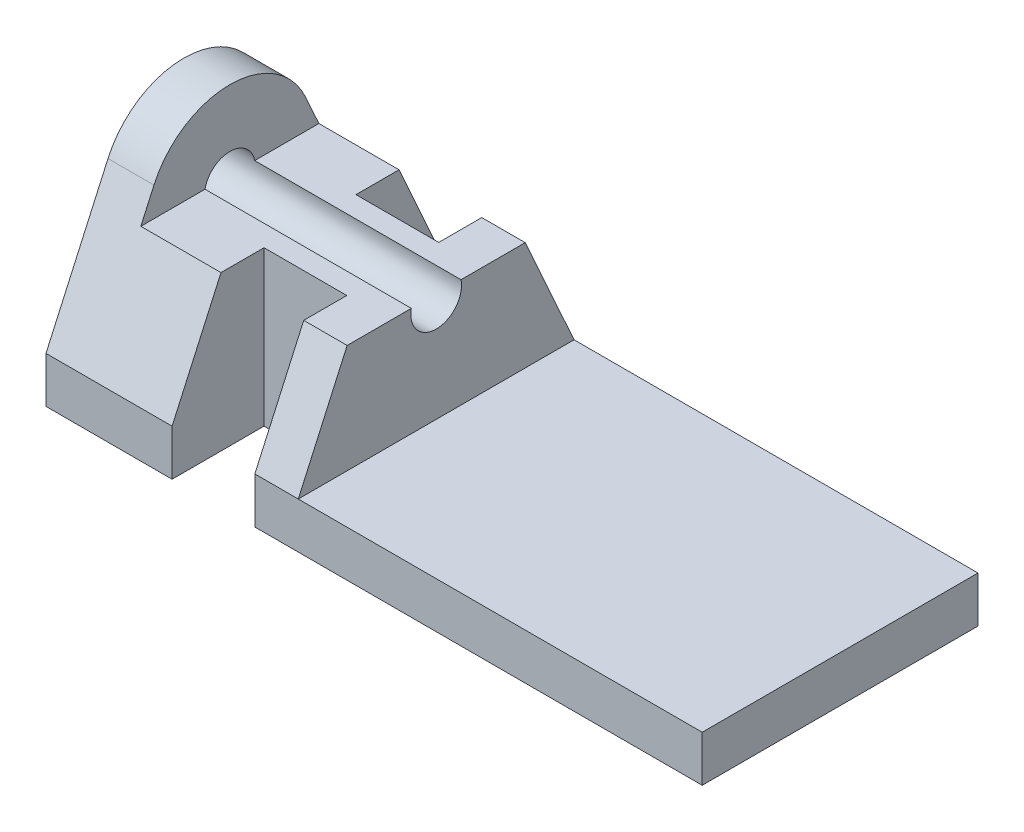
ISO-10303-21;
HEADER;
FILE_DESCRIPTION(('STEP AP214'),'2;1');
FILE_NAME('part.step','',(''),(''),'','','');
FILE_SCHEMA(('AUTOMOTIVE_DESIGN { 1 0 10303 214 1 1 1 1 }'));
ENDSEC;
DATA;
#1=APPLICATION_CONTEXT('core data for automotive mechanical design processes');
#2=APPLICATION_PROTOCOL_DEFINITION('international standard','automotive_design',2000,#1);
#3=PRODUCT_CONTEXT('',#1,'mechanical');
#4=PRODUCT('Part','Part','',(#3));
#5=PRODUCT_RELATED_PRODUCT_CATEGORY('part','',(#4));
#6=PRODUCT_DEFINITION_FORMATION('','',#4);
#7=PRODUCT_DEFINITION_CONTEXT('part definition',#1,'design');
#8=PRODUCT_DEFINITION('design','',#6,#7);
#9=PRODUCT_DEFINITION_SHAPE('','',#8);
#10=(LENGTH_UNIT() NAMED_UNIT(*) SI_UNIT(.MILLI.,.METRE.));
#11=(NAMED_UNIT(*) PLANE_ANGLE_UNIT() SI_UNIT($,.RADIAN.));
#12=(NAMED_UNIT(*) SI_UNIT($,.STERADIAN.) SOLID_ANGLE_UNIT());
#13=UNCERTAINTY_MEASURE_WITH_UNIT(LENGTH_MEASURE(1.E-05),#10,'distance_accuracy_value','');
#14=(GEOMETRIC_REPRESENTATION_CONTEXT(3) GLOBAL_UNCERTAINTY_ASSIGNED_CONTEXT((#13)) GLOBAL_UNIT_ASSIGNED_CONTEXT((#10,
#11,#12)) REPRESENTATION_CONTEXT('',''));
#15=CARTESIAN_POINT('',(0.,0.,0.));
#16=DIRECTION('',(0.,0.,1.));
#17=DIRECTION('',(1.,0.,0.));
#18=AXIS2_PLACEMENT_3D('',#15,#16,#17);
#19=CARTESIAN_POINT('',(-69.85,-6.35,19.05));
#20=DIRECTION('',(0.,0.,1.));
#21=DIRECTION('',(0.,-1.,0.));
#22=AXIS2_PLACEMENT_3D('',#19,#20,#21);
#23=PLANE('',#22);
#24=DIRECTION('',(0.,-1.,0.));
#25=VECTOR('',#24,1.);
#26=CARTESIAN_POINT('',(-52.43,-6.35,19.05));
#27=LINE('',#26,#25);
#28=CARTESIAN_POINT('',(-52.43,0.,19.05));
#29=VERTEX_POINT('',#28);
#30=CARTESIAN_POINT('',(-52.43,-6.35,19.05));
#31=VERTEX_POINT('',#30);
#32=EDGE_CURVE('E222',#29,#31,#27,.T.);
#33=ORIENTED_EDGE('',*,*,#32,.F.);
#34=DIRECTION('',(1.,0.,0.));
#35=VECTOR('',#34,1.);
#36=CARTESIAN_POINT('',(-69.85,0.,19.05));
#37=LINE('',#36,#35);
#38=CARTESIAN_POINT('',(-69.85,0.,19.05));
#39=VERTEX_POINT('',#38);
#40=EDGE_CURVE('E276',#39,#29,#37,.T.);
#41=ORIENTED_EDGE('',*,*,#40,.F.);
#42=DIRECTION('',(0.,-1.,0.));
#43=VECTOR('',#42,1.);
#44=CARTESIAN_POINT('',(-69.85,-6.35,19.05));
#45=LINE('',#44,#43);
#46=CARTESIAN_POINT('',(-69.85,-6.35,19.05));
#47=VERTEX_POINT('',#46);
#48=EDGE_CURVE('E304',#39,#47,#45,.T.);
#49=ORIENTED_EDGE('',*,*,#48,.T.);
#50=DIRECTION('',(1.,0.,0.));
#51=VECTOR('',#50,1.);
#52=CARTESIAN_POINT('',(-69.85,-6.35,19.05));
#53=LINE('',#52,#51);
#54=EDGE_CURVE('E307',#47,#31,#53,.T.);
#55=ORIENTED_EDGE('',*,*,#54,.T.);
#56=EDGE_LOOP('',(#33,#41,#49,#55));
#57=FACE_BOUND('',#56,.T.);
#58=ADVANCED_FACE('F33',(#57),#23,.T.);
#59=CARTESIAN_POINT('',(-69.85,-6.34999999999999,-19.05));
#60=DIRECTION('',(0.,0.,-1.));
#61=DIRECTION('',(0.,1.,0.));
#62=AXIS2_PLACEMENT_3D('',#59,#60,#61);
#63=PLANE('',#62);
#64=DIRECTION('',(0.,1.,0.));
#65=VECTOR('',#64,1.);
#66=CARTESIAN_POINT('',(-52.43,-6.34999999999999,-19.05));
#67=LINE('',#66,#65);
#68=CARTESIAN_POINT('',(-52.43,-6.35,-19.05));
#69=VERTEX_POINT('',#68);
#70=CARTESIAN_POINT('',(-52.43,0.,-19.05));
#71=VERTEX_POINT('',#70);
#72=EDGE_CURVE('E227',#69,#71,#67,.T.);
#73=ORIENTED_EDGE('',*,*,#72,.F.);
#74=DIRECTION('',(1.,0.,0.));
#75=VECTOR('',#74,1.);
#76=CARTESIAN_POINT('',(-69.85,-6.34999999999999,-19.05));
#77=LINE('',#76,#75);
#78=CARTESIAN_POINT('',(-69.85,-6.34999999999999,-19.05));
#79=VERTEX_POINT('',#78);
#80=EDGE_CURVE('E311',#79,#69,#77,.T.);
#81=ORIENTED_EDGE('',*,*,#80,.F.);
#82=DIRECTION('',(0.,1.,0.));
#83=VECTOR('',#82,1.);
#84=CARTESIAN_POINT('',(-69.85,-6.34999999999999,-19.05));
#85=LINE('',#84,#83);
#86=CARTESIAN_POINT('',(-69.85,0.,-19.05));
#87=VERTEX_POINT('',#86);
#88=EDGE_CURVE('E301',#79,#87,#85,.T.);
#89=ORIENTED_EDGE('',*,*,#88,.T.);
#90=DIRECTION('',(1.,0.,0.));
#91=VECTOR('',#90,1.);
#92=CARTESIAN_POINT('',(-69.85,0.,-19.05));
#93=LINE('',#92,#91);
#94=EDGE_CURVE('E265',#87,#71,#93,.T.);
#95=ORIENTED_EDGE('',*,*,#94,.T.);
#96=EDGE_LOOP('',(#73,#81,#89,#95));
#97=FACE_BOUND('',#96,.T.);
#98=ADVANCED_FACE('F401',(#97),#63,.T.);
#99=CARTESIAN_POINT('',(-69.85,0.,-19.05));
#100=DIRECTION('',(0.,-0.410407540402517,0.911902215580572));
#101=DIRECTION('',(0.,-0.911902215580572,-0.410407540402517));
#102=AXIS2_PLACEMENT_3D('',#99,#100,#101);
#103=PLANE('',#102);
#104=DIRECTION('',(-1.,0.,0.));
#105=VECTOR('',#104,1.);
#106=CARTESIAN_POINT('',(0.,15.,-12.2991521559487));
#107=LINE('',#106,#105);
#108=CARTESIAN_POINT('',(-52.43,15.,-12.2991521559487));
#109=VERTEX_POINT('',#108);
#110=CARTESIAN_POINT('',(-63.5,15.,-12.2991521559487));
#111=VERTEX_POINT('',#110);
#112=EDGE_CURVE('E323',#109,#111,#107,.T.);
#113=ORIENTED_EDGE('',*,*,#112,.F.);
#114=DIRECTION('',(0.,-0.911902215580572,-0.410407540402517));
#115=VECTOR('',#114,1.);
#116=CARTESIAN_POINT('',(-52.43,0.,-19.05));
#117=LINE('',#116,#115);
#118=EDGE_CURVE('E11',#109,#71,#117,.T.);
#119=ORIENTED_EDGE('',*,*,#118,.T.);
#120=ORIENTED_EDGE('',*,*,#94,.F.);
#121=DIRECTION('',(0.,-0.911902215580572,-0.410407540402517));
#122=VECTOR('',#121,1.);
#123=CARTESIAN_POINT('',(-69.85,0.,-19.05));
#124=LINE('',#123,#122);
#125=CARTESIAN_POINT('',(-69.85,19.0267757146289,-10.4868754791766));
#126=VERTEX_POINT('',#125);
#127=EDGE_CURVE('E261',#126,#87,#124,.T.);
#128=ORIENTED_EDGE('',*,*,#127,.F.);
#129=DIRECTION('',(1.,0.,0.));
#130=VECTOR('',#129,1.);
#131=CARTESIAN_POINT('',(-69.85,19.0267757146289,-10.4868754791766));
#132=LINE('',#131,#130);
#133=CARTESIAN_POINT('',(-63.5,19.0267757146289,-10.4868754791766));
#134=VERTEX_POINT('',#133);
#135=EDGE_CURVE('E270',#126,#134,#132,.T.);
#136=ORIENTED_EDGE('',*,*,#135,.T.);
#137=DIRECTION('',(0.,0.911902215580572,0.410407540402517));
#138=VECTOR('',#137,1.);
#139=CARTESIAN_POINT('',(-63.5,22.4581675399788,-8.94255520542602));
#140=LINE('',#139,#138);
#141=EDGE_CURVE('E321',#111,#134,#140,.T.);
#142=ORIENTED_EDGE('',*,*,#141,.F.);
#143=EDGE_LOOP('',(#113,#119,#120,#128,#136,#142));
#144=FACE_BOUND('',#143,.T.);
#145=ADVANCED_FACE('F361',(#144),#103,.F.);
#146=CARTESIAN_POINT('',(-69.85,0.,19.05));
#147=DIRECTION('',(0.,-0.410407540402517,-0.911902215580572));
#148=DIRECTION('',(0.,0.911902215580572,-0.410407540402517));
#149=AXIS2_PLACEMENT_3D('',#146,#147,#148);
#150=PLANE('',#149);
#151=ORIENTED_EDGE('',*,*,#40,.T.);
#152=DIRECTION('',(0.,0.911902215580572,-0.410407540402517));
#153=VECTOR('',#152,1.);
#154=CARTESIAN_POINT('',(-52.43,0.,19.05));
#155=LINE('',#154,#153);
#156=CARTESIAN_POINT('',(-52.43,15.,12.2991521559487));
#157=VERTEX_POINT('',#156);
#158=EDGE_CURVE('E219',#29,#157,#155,.T.);
#159=ORIENTED_EDGE('',*,*,#158,.T.);
#160=DIRECTION('',(1.,0.,0.));
#161=VECTOR('',#160,1.);
#162=CARTESIAN_POINT('',(0.,15.,12.2991521559487));
#163=LINE('',#162,#161);
#164=CARTESIAN_POINT('',(-63.5,15.,12.2991521559487));
#165=VERTEX_POINT('',#164);
#166=EDGE_CURVE('E328',#165,#157,#163,.T.);
#167=ORIENTED_EDGE('',*,*,#166,.F.);
#168=DIRECTION('',(0.,-0.911902215580572,0.410407540402517));
#169=VECTOR('',#168,1.);
#170=CARTESIAN_POINT('',(-63.5,36.7171514191103,2.52520650017285));
#171=LINE('',#170,#169);
#172=CARTESIAN_POINT('',(-63.5,19.0267757146289,10.4868754791766));
#173=VERTEX_POINT('',#172);
#174=EDGE_CURVE('E310',#173,#165,#171,.T.);
#175=ORIENTED_EDGE('',*,*,#174,.F.);
#176=DIRECTION('',(1.,0.,0.));
#177=VECTOR('',#176,1.);
#178=CARTESIAN_POINT('',(-69.85,19.0267757146289,10.4868754791766));
#179=LINE('',#178,#177);
#180=CARTESIAN_POINT('',(-69.85,19.0267757146289,10.4868754791766));
#181=VERTEX_POINT('',#180);
#182=EDGE_CURVE('E273',#181,#173,#179,.T.);
#183=ORIENTED_EDGE('',*,*,#182,.F.);
#184=DIRECTION('',(0.,0.911902215580572,-0.410407540402517));
#185=VECTOR('',#184,1.);
#186=CARTESIAN_POINT('',(-69.85,0.,19.05));
#187=LINE('',#186,#185);
#188=EDGE_CURVE('E252',#39,#181,#187,.T.);
#189=ORIENTED_EDGE('',*,*,#188,.F.);
#190=EDGE_LOOP('',(#151,#159,#167,#175,#183,#189));
#191=FACE_BOUND('',#190,.T.);
#192=ADVANCED_FACE('F411',(#191),#150,.F.);
#193=CARTESIAN_POINT('',(0.,15.,0.));
#194=DIRECTION('',(0.,-1.,0.));
#195=DIRECTION('',(0.,0.,-1.));
#196=AXIS2_PLACEMENT_3D('',#193,#194,#195);
#197=PLANE('',#196);
#198=DIRECTION('',(-1.,0.,0.));
#199=VECTOR('',#198,1.);
#200=CARTESIAN_POINT('',(0.,15.,-6.35));
#201=LINE('',#200,#199);
#202=CARTESIAN_POINT('',(-41.,15.,-6.35));
#203=VERTEX_POINT('',#202);
#204=CARTESIAN_POINT('',(-52.43,15.,-6.35000000000001));
#205=VERTEX_POINT('',#204);
#206=EDGE_CURVE('E232',#203,#205,#201,.T.);
#207=ORIENTED_EDGE('',*,*,#206,.T.);
#208=DIRECTION('',(0.,0.,-1.));
#209=VECTOR('',#208,1.);
#210=CARTESIAN_POINT('',(-52.43,15.,0.));
#211=LINE('',#210,#209);
#212=EDGE_CURVE('E229',#205,#109,#211,.T.);
#213=ORIENTED_EDGE('',*,*,#212,.T.);
#214=ORIENTED_EDGE('',*,*,#112,.T.);
#215=DIRECTION('',(0.,0.,1.));
#216=VECTOR('',#215,1.);
#217=CARTESIAN_POINT('',(-63.5,15.,19.05));
#218=LINE('',#217,#216);
#219=CARTESIAN_POINT('',(-63.5,15.,-3.43072504670354));
#220=VERTEX_POINT('',#219);
#221=EDGE_CURVE('E248',#111,#220,#218,.T.);
#222=ORIENTED_EDGE('',*,*,#221,.T.);
#223=DIRECTION('',(1.,0.,0.));
#224=VECTOR('',#223,1.);
#225=CARTESIAN_POINT('',(-69.85,15.,-3.43072504670354));
#226=LINE('',#225,#224);
#227=CARTESIAN_POINT('',(-35.,15.,-3.43072504670354));
#228=VERTEX_POINT('',#227);
#229=EDGE_CURVE('E333',#220,#228,#226,.T.);
#230=ORIENTED_EDGE('',*,*,#229,.T.);
#231=DIRECTION('',(0.,0.,-1.));
#232=VECTOR('',#231,1.);
#233=CARTESIAN_POINT('',(-35.,15.,19.05));
#234=LINE('',#233,#232);
#235=CARTESIAN_POINT('',(-35.,15.,-12.2991521559487));
#236=VERTEX_POINT('',#235);
#237=EDGE_CURVE('E253',#228,#236,#234,.T.);
#238=ORIENTED_EDGE('',*,*,#237,.T.);
#239=CARTESIAN_POINT('',(-41.,15.,-12.2991521559487));
#240=VERTEX_POINT('',#239);
#241=EDGE_CURVE('E324',#236,#240,#107,.T.);
#242=ORIENTED_EDGE('',*,*,#241,.T.);
#243=DIRECTION('',(0.,0.,1.));
#244=VECTOR('',#243,1.);
#245=CARTESIAN_POINT('',(-41.,15.,0.));
#246=LINE('',#245,#244);
#247=EDGE_CURVE('E48',#240,#203,#246,.T.);
#248=ORIENTED_EDGE('',*,*,#247,.T.);
#249=EDGE_LOOP('',(#207,#213,#214,#222,#230,#238,#242,#248));
#250=FACE_BOUND('',#249,.T.);
#251=ADVANCED_FACE('F348',(#250),#197,.F.);
#252=CARTESIAN_POINT('',(-63.5,0.,-19.05));
#253=DIRECTION('',(0.,-1.,0.));
#254=DIRECTION('',(0.,0.,-1.));
#255=AXIS2_PLACEMENT_3D('',#252,#253,#254);
#256=PLANE('',#255);
#257=DIRECTION('',(0.,0.,-1.));
#258=VECTOR('',#257,1.);
#259=CARTESIAN_POINT('',(-35.,0.,19.05));
#260=LINE('',#259,#258);
#261=CARTESIAN_POINT('',(-35.,0.,19.05));
#262=VERTEX_POINT('',#261);
#263=CARTESIAN_POINT('',(-35.,0.,-19.05));
#264=VERTEX_POINT('',#263);
#265=EDGE_CURVE('E244',#262,#264,#260,.T.);
#266=ORIENTED_EDGE('',*,*,#265,.F.);
#267=DIRECTION('',(1.,0.,0.));
#268=VECTOR('',#267,1.);
#269=CARTESIAN_POINT('',(-63.5,0.,19.05));
#270=LINE('',#269,#268);
#271=CARTESIAN_POINT('',(20.8,0.,19.05));
#272=VERTEX_POINT('',#271);
#273=EDGE_CURVE('E285',#262,#272,#270,.T.);
#274=ORIENTED_EDGE('',*,*,#273,.T.);
#275=DIRECTION('',(0.,0.,1.));
#276=VECTOR('',#275,1.);
#277=CARTESIAN_POINT('',(20.8,0.,-19.05));
#278=LINE('',#277,#276);
#279=CARTESIAN_POINT('',(20.8,0.,-19.05));
#280=VERTEX_POINT('',#279);
#281=EDGE_CURVE('E284',#280,#272,#278,.T.);
#282=ORIENTED_EDGE('',*,*,#281,.F.);
#283=DIRECTION('',(1.,0.,0.));
#284=VECTOR('',#283,1.);
#285=CARTESIAN_POINT('',(-63.5,0.,-19.05));
#286=LINE('',#285,#284);
#287=EDGE_CURVE('E282',#264,#280,#286,.T.);
#288=ORIENTED_EDGE('',*,*,#287,.F.);
#289=EDGE_LOOP('',(#266,#274,#282,#288));
#290=FACE_BOUND('',#289,.T.);
#291=ADVANCED_FACE('F380',(#290),#256,.F.);
#292=CARTESIAN_POINT('',(-63.5,27.007089,-19.05));
#293=DIRECTION('',(-1.,0.,0.));
#294=DIRECTION('',(0.,0.,1.));
#295=AXIS2_PLACEMENT_3D('',#292,#293,#294);
#296=PLANE('',#295);
#297=ORIENTED_EDGE('',*,*,#221,.F.);
#298=ORIENTED_EDGE('',*,*,#141,.T.);
#299=CARTESIAN_POINT('',(-63.5,14.307089,0.));
#300=DIRECTION('',(-1.,0.,0.));
#301=DIRECTION('',(0.,0.,1.));
#302=AXIS2_PLACEMENT_3D('',#299,#300,#301);
#303=CIRCLE('',#302,11.5);
#304=EDGE_CURVE('E318',#134,#173,#303,.F.);
#305=ORIENTED_EDGE('',*,*,#304,.T.);
#306=ORIENTED_EDGE('',*,*,#174,.T.);
#307=CARTESIAN_POINT('',(-63.5,15.,3.43072504670354));
#308=VERTEX_POINT('',#307);
#309=EDGE_CURVE('E245',#308,#165,#218,.T.);
#310=ORIENTED_EDGE('',*,*,#309,.F.);
#311=CARTESIAN_POINT('',(-63.5,14.307089,0.));
#312=DIRECTION('',(-1.,0.,0.));
#313=DIRECTION('',(0.,0.,1.));
#314=AXIS2_PLACEMENT_3D('',#311,#312,#313);
#315=CIRCLE('',#314,3.5);
#316=EDGE_CURVE('E281',#308,#220,#315,.T.);
#317=ORIENTED_EDGE('',*,*,#316,.T.);
#318=EDGE_LOOP('',(#297,#298,#305,#306,#310,#317));
#319=FACE_BOUND('',#318,.T.);
#320=ADVANCED_FACE('F356',(#319),#296,.F.);
#321=CARTESIAN_POINT('',(-69.85,-6.35,19.05));
#322=DIRECTION('',(0.,-1.,0.));
#323=DIRECTION('',(0.,0.,-1.));
#324=AXIS2_PLACEMENT_3D('',#321,#322,#323);
#325=PLANE('',#324);
#326=DIRECTION('',(0.,0.,1.));
#327=VECTOR('',#326,1.);
#328=CARTESIAN_POINT('',(-52.43,-6.35,6.35000000000001));
#329=LINE('',#328,#327);
#330=CARTESIAN_POINT('',(-52.43,-6.35,6.35000000000001));
#331=VERTEX_POINT('',#330);
#332=EDGE_CURVE('E185',#331,#31,#329,.T.);
#333=ORIENTED_EDGE('',*,*,#332,.T.);
#334=ORIENTED_EDGE('',*,*,#54,.F.);
#335=DIRECTION('',(0.,0.,-1.));
#336=VECTOR('',#335,1.);
#337=CARTESIAN_POINT('',(-69.85,-6.35,19.05));
#338=LINE('',#337,#336);
#339=EDGE_CURVE('E298',#47,#79,#338,.T.);
#340=ORIENTED_EDGE('',*,*,#339,.T.);
#341=ORIENTED_EDGE('',*,*,#80,.T.);
#342=DIRECTION('',(0.,0.,1.));
#343=VECTOR('',#342,1.);
#344=CARTESIAN_POINT('',(-52.43,-6.35,-6.35000000000001));
#345=LINE('',#344,#343);
#346=CARTESIAN_POINT('',(-52.43,-6.35,-6.35000000000001));
#347=VERTEX_POINT('',#346);
#348=EDGE_CURVE('E205',#69,#347,#345,.T.);
#349=ORIENTED_EDGE('',*,*,#348,.T.);
#350=DIRECTION('',(1.,0.,0.));
#351=VECTOR('',#350,1.);
#352=CARTESIAN_POINT('',(-41.,-6.35,-6.35));
#353=LINE('',#352,#351);
#354=CARTESIAN_POINT('',(-41.,-6.35,-6.35));
#355=VERTEX_POINT('',#354);
#356=EDGE_CURVE('E208',#347,#355,#353,.T.);
#357=ORIENTED_EDGE('',*,*,#356,.T.);
#358=DIRECTION('',(0.,0.,-1.));
#359=VECTOR('',#358,1.);
#360=CARTESIAN_POINT('',(-41.,-6.35,-31.75));
#361=LINE('',#360,#359);
#362=CARTESIAN_POINT('',(-41.,-6.35,-19.05));
#363=VERTEX_POINT('',#362);
#364=EDGE_CURVE('E211',#355,#363,#361,.T.);
#365=ORIENTED_EDGE('',*,*,#364,.T.);
#366=CARTESIAN_POINT('',(20.8,-6.34999999999999,-19.05));
#367=VERTEX_POINT('',#366);
#368=EDGE_CURVE('E306',#363,#367,#77,.T.);
#369=ORIENTED_EDGE('',*,*,#368,.T.);
#370=DIRECTION('',(0.,0.,-1.));
#371=VECTOR('',#370,1.);
#372=CARTESIAN_POINT('',(20.8,-6.35,19.05));
#373=LINE('',#372,#371);
#374=CARTESIAN_POINT('',(20.8,-6.35,19.05));
#375=VERTEX_POINT('',#374);
#376=EDGE_CURVE('E289',#375,#367,#373,.T.);
#377=ORIENTED_EDGE('',*,*,#376,.F.);
#378=CARTESIAN_POINT('',(-41.,-6.35,19.05));
#379=VERTEX_POINT('',#378);
#380=EDGE_CURVE('E197',#379,#375,#53,.T.);
#381=ORIENTED_EDGE('',*,*,#380,.F.);
#382=DIRECTION('',(0.,0.,-1.));
#383=VECTOR('',#382,1.);
#384=CARTESIAN_POINT('',(-41.,-6.35,31.75));
#385=LINE('',#384,#383);
#386=CARTESIAN_POINT('',(-41.,-6.35,6.35));
#387=VERTEX_POINT('',#386);
#388=EDGE_CURVE('E179',#379,#387,#385,.T.);
#389=ORIENTED_EDGE('',*,*,#388,.T.);
#390=DIRECTION('',(-1.,0.,0.));
#391=VECTOR('',#390,1.);
#392=CARTESIAN_POINT('',(-41.,-6.35,6.35));
#393=LINE('',#392,#391);
#394=EDGE_CURVE('E188',#387,#331,#393,.T.);
#395=ORIENTED_EDGE('',*,*,#394,.T.);
#396=EDGE_LOOP('',(#333,#334,#340,#341,#349,#357,#365,#369,#377,#381,#389,#395));
#397=FACE_BOUND('',#396,.T.);
#398=ADVANCED_FACE('F35',(#397),#325,.T.);
#399=DIRECTION('',(0.,1.,0.));
#400=VECTOR('',#399,1.);
#401=CARTESIAN_POINT('',(-41.,-6.35,19.05));
#402=LINE('',#401,#400);
#403=CARTESIAN_POINT('',(-41.,0.,19.05));
#404=VERTEX_POINT('',#403);
#405=EDGE_CURVE('E217',#379,#404,#402,.T.);
#406=ORIENTED_EDGE('',*,*,#405,.F.);
#407=ORIENTED_EDGE('',*,*,#380,.T.);
#408=DIRECTION('',(0.,-1.,0.));
#409=VECTOR('',#408,1.);
#410=CARTESIAN_POINT('',(20.8,-6.35,19.05));
#411=LINE('',#410,#409);
#412=EDGE_CURVE('E295',#272,#375,#411,.T.);
#413=ORIENTED_EDGE('',*,*,#412,.F.);
#414=ORIENTED_EDGE('',*,*,#273,.F.);
#415=EDGE_CURVE('E264',#404,#262,#37,.T.);
#416=ORIENTED_EDGE('',*,*,#415,.F.);
#417=EDGE_LOOP('',(#406,#407,#413,#414,#416));
#418=FACE_BOUND('',#417,.T.);
#419=ADVANCED_FACE('F385',(#418),#23,.T.);
#420=DIRECTION('',(0.,-1.,0.));
#421=VECTOR('',#420,1.);
#422=CARTESIAN_POINT('',(-41.,-6.34999999999999,-19.05));
#423=LINE('',#422,#421);
#424=CARTESIAN_POINT('',(-41.,0.,-19.05));
#425=VERTEX_POINT('',#424);
#426=EDGE_CURVE('E224',#425,#363,#423,.T.);
#427=ORIENTED_EDGE('',*,*,#426,.F.);
#428=EDGE_CURVE('E269',#425,#264,#93,.T.);
#429=ORIENTED_EDGE('',*,*,#428,.T.);
#430=ORIENTED_EDGE('',*,*,#287,.T.);
#431=DIRECTION('',(0.,1.,0.));
#432=VECTOR('',#431,1.);
#433=CARTESIAN_POINT('',(20.8,-6.34999999999999,-19.05));
#434=LINE('',#433,#432);
#435=EDGE_CURVE('E292',#367,#280,#434,.T.);
#436=ORIENTED_EDGE('',*,*,#435,.F.);
#437=ORIENTED_EDGE('',*,*,#368,.F.);
#438=EDGE_LOOP('',(#427,#429,#430,#436,#437));
#439=FACE_BOUND('',#438,.T.);
#440=ADVANCED_FACE('F392',(#439),#63,.T.);
#441=CARTESIAN_POINT('',(-69.85,0.,0.));
#442=DIRECTION('',(1.,0.,0.));
#443=DIRECTION('',(0.,0.,-1.));
#444=AXIS2_PLACEMENT_3D('',#441,#442,#443);
#445=PLANE('',#444);
#446=CARTESIAN_POINT('',(-69.85,14.307089,0.));
#447=DIRECTION('',(1.,0.,0.));
#448=DIRECTION('',(0.,0.,-1.));
#449=AXIS2_PLACEMENT_3D('',#446,#447,#448);
#450=CIRCLE('',#449,3.5);
#451=CARTESIAN_POINT('',(-69.85,14.307089,-3.5));
#452=VERTEX_POINT('',#451);
#453=EDGE_CURVE('E268',#452,#452,#450,.T.);
#454=ORIENTED_EDGE('',*,*,#453,.T.);
#455=EDGE_LOOP('',(#454));
#456=FACE_BOUND('',#455,.T.);
#457=CARTESIAN_POINT('',(-69.85,14.307089,0.));
#458=DIRECTION('',(-1.,0.,0.));
#459=DIRECTION('',(0.,0.,-1.));
#460=AXIS2_PLACEMENT_3D('',#457,#458,#459);
#461=CIRCLE('',#460,11.5);
#462=EDGE_CURVE('E258',#181,#126,#461,.T.);
#463=ORIENTED_EDGE('',*,*,#462,.T.);
#464=ORIENTED_EDGE('',*,*,#127,.T.);
#465=ORIENTED_EDGE('',*,*,#88,.F.);
#466=ORIENTED_EDGE('',*,*,#339,.F.);
#467=ORIENTED_EDGE('',*,*,#48,.F.);
#468=ORIENTED_EDGE('',*,*,#188,.T.);
#469=EDGE_LOOP('',(#463,#464,#465,#466,#467,#468));
#470=FACE_BOUND('',#469,.T.);
#471=ADVANCED_FACE('F405',(#456,#470),#445,.F.);
#472=CARTESIAN_POINT('',(20.8,0.,0.));
#473=DIRECTION('',(1.,0.,0.));
#474=DIRECTION('',(0.,0.,-1.));
#475=AXIS2_PLACEMENT_3D('',#472,#473,#474);
#476=PLANE('',#475);
#477=ORIENTED_EDGE('',*,*,#281,.T.);
#478=ORIENTED_EDGE('',*,*,#412,.T.);
#479=ORIENTED_EDGE('',*,*,#376,.T.);
#480=ORIENTED_EDGE('',*,*,#435,.T.);
#481=EDGE_LOOP('',(#477,#478,#479,#480));
#482=FACE_BOUND('',#481,.T.);
#483=ADVANCED_FACE('F387',(#482),#476,.T.);
#484=CARTESIAN_POINT('',(-69.85,14.307089,0.));
#485=DIRECTION('',(1.,0.,0.));
#486=DIRECTION('',(0.,0.,-1.));
#487=AXIS2_PLACEMENT_3D('',#484,#485,#486);
#488=CYLINDRICAL_SURFACE('',#487,3.5);
#489=ORIENTED_EDGE('',*,*,#453,.F.);
#490=EDGE_LOOP('',(#489));
#491=FACE_BOUND('',#490,.T.);
#492=ORIENTED_EDGE('',*,*,#316,.F.);
#493=DIRECTION('',(1.,0.,0.));
#494=VECTOR('',#493,1.);
#495=CARTESIAN_POINT('',(-69.85,15.,3.43072504670354));
#496=LINE('',#495,#494);
#497=CARTESIAN_POINT('',(-35.,15.,3.43072504670354));
#498=VERTEX_POINT('',#497);
#499=EDGE_CURVE('E331',#498,#308,#496,.F.);
#500=ORIENTED_EDGE('',*,*,#499,.F.);
#501=CARTESIAN_POINT('',(-35.,14.307089,0.));
#502=DIRECTION('',(-1.,0.,0.));
#503=DIRECTION('',(0.,0.,1.));
#504=AXIS2_PLACEMENT_3D('',#501,#502,#503);
#505=CIRCLE('',#504,3.5);
#506=EDGE_CURVE('E235',#228,#498,#505,.T.);
#507=ORIENTED_EDGE('',*,*,#506,.F.);
#508=ORIENTED_EDGE('',*,*,#229,.F.);
#509=EDGE_LOOP('',(#492,#500,#507,#508));
#510=FACE_BOUND('',#509,.T.);
#511=ADVANCED_FACE('F371',(#491,#510),#488,.F.);
#512=ORIENTED_EDGE('',*,*,#428,.F.);
#513=DIRECTION('',(0.,0.911902215580572,0.410407540402517));
#514=VECTOR('',#513,1.);
#515=CARTESIAN_POINT('',(-41.,0.,-19.05));
#516=LINE('',#515,#514);
#517=EDGE_CURVE('E41',#425,#240,#516,.T.);
#518=ORIENTED_EDGE('',*,*,#517,.T.);
#519=ORIENTED_EDGE('',*,*,#241,.F.);
#520=DIRECTION('',(0.,0.911902215580573,0.410407540402517));
#521=VECTOR('',#520,1.);
#522=CARTESIAN_POINT('',(-35.,26.7324686408428,-7.01887811398641));
#523=LINE('',#522,#521);
#524=EDGE_CURVE('E241',#264,#236,#523,.T.);
#525=ORIENTED_EDGE('',*,*,#524,.F.);
#526=EDGE_LOOP('',(#512,#518,#519,#525));
#527=FACE_BOUND('',#526,.T.);
#528=ADVANCED_FACE('F344',(#527),#103,.F.);
#529=CARTESIAN_POINT('',(-69.85,14.307089,0.));
#530=DIRECTION('',(1.,0.,0.));
#531=DIRECTION('',(0.,0.,-1.));
#532=AXIS2_PLACEMENT_3D('',#529,#530,#531);
#533=CYLINDRICAL_SURFACE('',#532,11.5);
#534=ORIENTED_EDGE('',*,*,#135,.F.);
#535=ORIENTED_EDGE('',*,*,#462,.F.);
#536=ORIENTED_EDGE('',*,*,#182,.T.);
#537=ORIENTED_EDGE('',*,*,#304,.F.);
#538=EDGE_LOOP('',(#534,#535,#536,#537));
#539=FACE_BOUND('',#538,.T.);
#540=ADVANCED_FACE('F365',(#539),#533,.T.);
#541=CARTESIAN_POINT('',(-41.,15.,12.2991521559487));
#542=VERTEX_POINT('',#541);
#543=CARTESIAN_POINT('',(-35.,15.,12.2991521559487));
#544=VERTEX_POINT('',#543);
#545=EDGE_CURVE('E327',#542,#544,#163,.T.);
#546=ORIENTED_EDGE('',*,*,#545,.F.);
#547=DIRECTION('',(0.,-0.911902215580572,0.410407540402517));
#548=VECTOR('',#547,1.);
#549=CARTESIAN_POINT('',(-41.,0.,19.05));
#550=LINE('',#549,#548);
#551=EDGE_CURVE('E56',#542,#404,#550,.T.);
#552=ORIENTED_EDGE('',*,*,#551,.T.);
#553=ORIENTED_EDGE('',*,*,#415,.T.);
#554=DIRECTION('',(0.,-0.911902215580572,0.410407540402517));
#555=VECTOR('',#554,1.);
#556=CARTESIAN_POINT('',(-35.,12.4734847617113,13.4362268192396));
#557=LINE('',#556,#555);
#558=EDGE_CURVE('E238',#544,#262,#557,.T.);
#559=ORIENTED_EDGE('',*,*,#558,.F.);
#560=EDGE_LOOP('',(#546,#552,#553,#559));
#561=FACE_BOUND('',#560,.T.);
#562=ADVANCED_FACE('F414',(#561),#150,.F.);
#563=CARTESIAN_POINT('',(-35.,15.,19.05));
#564=DIRECTION('',(-1.,0.,0.));
#565=DIRECTION('',(0.,0.,1.));
#566=AXIS2_PLACEMENT_3D('',#563,#564,#565);
#567=PLANE('',#566);
#568=ORIENTED_EDGE('',*,*,#237,.F.);
#569=ORIENTED_EDGE('',*,*,#506,.T.);
#570=EDGE_CURVE('E249',#544,#498,#234,.T.);
#571=ORIENTED_EDGE('',*,*,#570,.F.);
#572=ORIENTED_EDGE('',*,*,#558,.T.);
#573=ORIENTED_EDGE('',*,*,#265,.T.);
#574=ORIENTED_EDGE('',*,*,#524,.T.);
#575=EDGE_LOOP('',(#568,#569,#571,#572,#573,#574));
#576=FACE_BOUND('',#575,.T.);
#577=ADVANCED_FACE('F372',(#576),#567,.F.);
#578=ORIENTED_EDGE('',*,*,#166,.T.);
#579=DIRECTION('',(0.,0.,-1.));
#580=VECTOR('',#579,1.);
#581=CARTESIAN_POINT('',(-52.43,15.,0.));
#582=LINE('',#581,#580);
#583=CARTESIAN_POINT('',(-52.43,15.,6.35000000000001));
#584=VERTEX_POINT('',#583);
#585=EDGE_CURVE('E339',#157,#584,#582,.T.);
#586=ORIENTED_EDGE('',*,*,#585,.T.);
#587=DIRECTION('',(1.,0.,0.));
#588=VECTOR('',#587,1.);
#589=CARTESIAN_POINT('',(0.,15.,6.35));
#590=LINE('',#589,#588);
#591=CARTESIAN_POINT('',(-41.,15.,6.35));
#592=VERTEX_POINT('',#591);
#593=EDGE_CURVE('E337',#584,#592,#590,.T.);
#594=ORIENTED_EDGE('',*,*,#593,.T.);
#595=DIRECTION('',(0.,0.,1.));
#596=VECTOR('',#595,1.);
#597=CARTESIAN_POINT('',(-41.,15.,0.));
#598=LINE('',#597,#596);
#599=EDGE_CURVE('E181',#592,#542,#598,.T.);
#600=ORIENTED_EDGE('',*,*,#599,.T.);
#601=ORIENTED_EDGE('',*,*,#545,.T.);
#602=ORIENTED_EDGE('',*,*,#570,.T.);
#603=ORIENTED_EDGE('',*,*,#499,.T.);
#604=ORIENTED_EDGE('',*,*,#309,.T.);
#605=EDGE_LOOP('',(#578,#586,#594,#600,#601,#602,#603,#604));
#606=FACE_BOUND('',#605,.T.);
#607=ADVANCED_FACE('F368',(#606),#197,.F.);
#608=CARTESIAN_POINT('',(-41.,-6.35,6.35));
#609=DIRECTION('',(0.,0.,-1.));
#610=DIRECTION('',(-1.,0.,0.));
#611=AXIS2_PLACEMENT_3D('',#608,#609,#610);
#612=PLANE('',#611);
#613=DIRECTION('',(0.,1.,0.));
#614=VECTOR('',#613,1.);
#615=CARTESIAN_POINT('',(-52.43,-6.35,6.35000000000001));
#616=LINE('',#615,#614);
#617=EDGE_CURVE('E184',#331,#584,#616,.T.);
#618=ORIENTED_EDGE('',*,*,#617,.F.);
#619=ORIENTED_EDGE('',*,*,#394,.F.);
#620=DIRECTION('',(0.,1.,0.));
#621=VECTOR('',#620,1.);
#622=CARTESIAN_POINT('',(-41.,-6.35,6.35));
#623=LINE('',#622,#621);
#624=EDGE_CURVE('E175',#387,#592,#623,.T.);
#625=ORIENTED_EDGE('',*,*,#624,.T.);
#626=ORIENTED_EDGE('',*,*,#593,.F.);
#627=EDGE_LOOP('',(#618,#619,#625,#626));
#628=FACE_BOUND('',#627,.T.);
#629=ADVANCED_FACE('F189',(#628),#612,.F.);
#630=CARTESIAN_POINT('',(-52.43,-6.35,6.35000000000001));
#631=DIRECTION('',(-1.,0.,0.));
#632=DIRECTION('',(0.,0.,1.));
#633=AXIS2_PLACEMENT_3D('',#630,#631,#632);
#634=PLANE('',#633);
#635=ORIENTED_EDGE('',*,*,#32,.T.);
#636=ORIENTED_EDGE('',*,*,#332,.F.);
#637=ORIENTED_EDGE('',*,*,#617,.T.);
#638=ORIENTED_EDGE('',*,*,#585,.F.);
#639=ORIENTED_EDGE('',*,*,#158,.F.);
#640=EDGE_LOOP('',(#635,#636,#637,#638,#639));
#641=FACE_BOUND('',#640,.T.);
#642=ADVANCED_FACE('F413',(#641),#634,.F.);
#643=CARTESIAN_POINT('',(-41.,-6.35,31.75));
#644=DIRECTION('',(1.,0.,0.));
#645=DIRECTION('',(0.,0.,-1.));
#646=AXIS2_PLACEMENT_3D('',#643,#644,#645);
#647=PLANE('',#646);
#648=ORIENTED_EDGE('',*,*,#405,.T.);
#649=ORIENTED_EDGE('',*,*,#551,.F.);
#650=ORIENTED_EDGE('',*,*,#599,.F.);
#651=ORIENTED_EDGE('',*,*,#624,.F.);
#652=ORIENTED_EDGE('',*,*,#388,.F.);
#653=EDGE_LOOP('',(#648,#649,#650,#651,#652));
#654=FACE_BOUND('',#653,.T.);
#655=ADVANCED_FACE('F177',(#654),#647,.F.);
#656=CARTESIAN_POINT('',(-41.,-6.35,-6.35));
#657=DIRECTION('',(0.,0.,1.));
#658=DIRECTION('',(1.,0.,0.));
#659=AXIS2_PLACEMENT_3D('',#656,#657,#658);
#660=PLANE('',#659);
#661=DIRECTION('',(0.,1.,0.));
#662=VECTOR('',#661,1.);
#663=CARTESIAN_POINT('',(-41.,-6.35,-6.35));
#664=LINE('',#663,#662);
#665=EDGE_CURVE('E198',#355,#203,#664,.T.);
#666=ORIENTED_EDGE('',*,*,#665,.F.);
#667=ORIENTED_EDGE('',*,*,#356,.F.);
#668=DIRECTION('',(0.,1.,0.));
#669=VECTOR('',#668,1.);
#670=CARTESIAN_POINT('',(-52.43,-6.35,-6.35000000000001));
#671=LINE('',#670,#669);
#672=EDGE_CURVE('E200',#347,#205,#671,.T.);
#673=ORIENTED_EDGE('',*,*,#672,.T.);
#674=ORIENTED_EDGE('',*,*,#206,.F.);
#675=EDGE_LOOP('',(#666,#667,#673,#674));
#676=FACE_BOUND('',#675,.T.);
#677=ADVANCED_FACE('F396',(#676),#660,.F.);
#678=CARTESIAN_POINT('',(-52.43,-6.35,-6.35000000000001));
#679=DIRECTION('',(-1.,0.,0.));
#680=DIRECTION('',(0.,0.,1.));
#681=AXIS2_PLACEMENT_3D('',#678,#679,#680);
#682=PLANE('',#681);
#683=ORIENTED_EDGE('',*,*,#672,.F.);
#684=ORIENTED_EDGE('',*,*,#348,.F.);
#685=ORIENTED_EDGE('',*,*,#72,.T.);
#686=ORIENTED_EDGE('',*,*,#118,.F.);
#687=ORIENTED_EDGE('',*,*,#212,.F.);
#688=EDGE_LOOP('',(#683,#684,#685,#686,#687));
#689=FACE_BOUND('',#688,.T.);
#690=ADVANCED_FACE('F398',(#689),#682,.F.);
#691=CARTESIAN_POINT('',(-41.,-6.35,-31.75));
#692=DIRECTION('',(1.,0.,0.));
#693=DIRECTION('',(0.,0.,-1.));
#694=AXIS2_PLACEMENT_3D('',#691,#692,#693);
#695=PLANE('',#694);
#696=ORIENTED_EDGE('',*,*,#517,.F.);
#697=ORIENTED_EDGE('',*,*,#426,.T.);
#698=ORIENTED_EDGE('',*,*,#364,.F.);
#699=ORIENTED_EDGE('',*,*,#665,.T.);
#700=ORIENTED_EDGE('',*,*,#247,.F.);
#701=EDGE_LOOP('',(#696,#697,#698,#699,#700));
#702=FACE_BOUND('',#701,.T.);
#703=ADVANCED_FACE('F393',(#702),#695,.F.);
#704=CLOSED_SHELL('',(#58,#98,#145,#192,#251,#291,#320,#398,#419,#440,#471,#483,#511,#528,#540,
#562,#577,#607,#629,#642,#655,#677,#690,#703));
#705=MANIFOLD_SOLID_BREP('B2',#704);
#706=ADVANCED_BREP_SHAPE_REPRESENTATION('',(#18,#705),#14);
#707=SHAPE_DEFINITION_REPRESENTATION(#9,#706);
ENDSEC;
END-ISO-10303-21;
